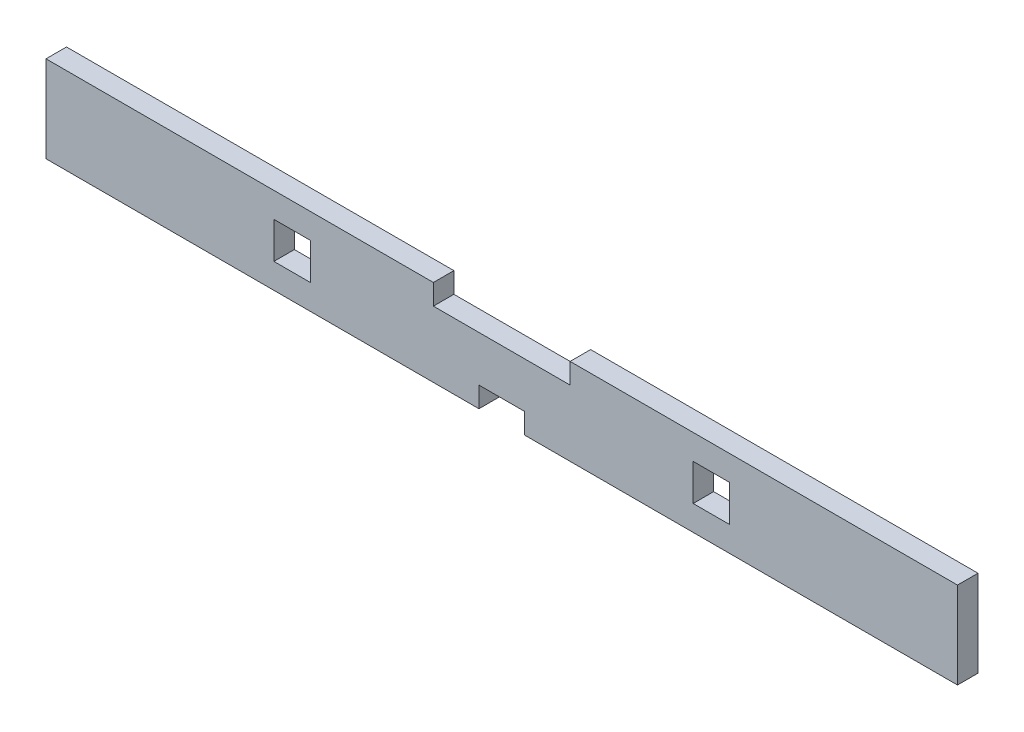
ISO-10303-21;
HEADER;
FILE_DESCRIPTION(('STEP AP214'),'2;1');
FILE_NAME('part.step','',(''),(''),'','','');
FILE_SCHEMA(('AUTOMOTIVE_DESIGN { 1 0 10303 214 1 1 1 1 }'));
ENDSEC;
DATA;
#1=APPLICATION_CONTEXT('core data for automotive mechanical design processes');
#2=APPLICATION_PROTOCOL_DEFINITION('international standard','automotive_design',2000,#1);
#3=PRODUCT_CONTEXT('',#1,'mechanical');
#4=PRODUCT('Part','Part','',(#3));
#5=PRODUCT_RELATED_PRODUCT_CATEGORY('part','',(#4));
#6=PRODUCT_DEFINITION_FORMATION('','',#4);
#7=PRODUCT_DEFINITION_CONTEXT('part definition',#1,'design');
#8=PRODUCT_DEFINITION('design','',#6,#7);
#9=PRODUCT_DEFINITION_SHAPE('','',#8);
#10=(LENGTH_UNIT() NAMED_UNIT(*) SI_UNIT(.MILLI.,.METRE.));
#11=(NAMED_UNIT(*) PLANE_ANGLE_UNIT() SI_UNIT($,.RADIAN.));
#12=(NAMED_UNIT(*) SI_UNIT($,.STERADIAN.) SOLID_ANGLE_UNIT());
#13=UNCERTAINTY_MEASURE_WITH_UNIT(LENGTH_MEASURE(1.E-05),#10,'distance_accuracy_value','');
#14=(GEOMETRIC_REPRESENTATION_CONTEXT(3) GLOBAL_UNCERTAINTY_ASSIGNED_CONTEXT((#13)) GLOBAL_UNIT_ASSIGNED_CONTEXT((#10,
#11,#12)) REPRESENTATION_CONTEXT('',''));
#15=CARTESIAN_POINT('',(0.,0.,0.));
#16=DIRECTION('',(0.,0.,1.));
#17=DIRECTION('',(1.,0.,0.));
#18=AXIS2_PLACEMENT_3D('',#15,#16,#17);
#19=CARTESIAN_POINT('',(127.,-25.4,5.715));
#20=DIRECTION('',(-1.,0.,0.));
#21=DIRECTION('',(0.,0.,1.));
#22=AXIS2_PLACEMENT_3D('',#19,#20,#21);
#23=PLANE('',#22);
#24=DIRECTION('',(0.,1.,0.));
#25=VECTOR('',#24,1.);
#26=CARTESIAN_POINT('',(127.,-25.4,0.));
#27=LINE('',#26,#25);
#28=CARTESIAN_POINT('',(127.,-12.065,0.));
#29=VERTEX_POINT('',#28);
#30=CARTESIAN_POINT('',(127.,12.065,0.));
#31=VERTEX_POINT('',#30);
#32=EDGE_CURVE('E210',#29,#31,#27,.T.);
#33=ORIENTED_EDGE('',*,*,#32,.T.);
#34=DIRECTION('',(0.,0.,1.));
#35=VECTOR('',#34,1.);
#36=CARTESIAN_POINT('',(127.,12.065,0.));
#37=LINE('',#36,#35);
#38=CARTESIAN_POINT('',(127.,12.065,5.715));
#39=VERTEX_POINT('',#38);
#40=EDGE_CURVE('E201',#31,#39,#37,.T.);
#41=ORIENTED_EDGE('',*,*,#40,.T.);
#42=DIRECTION('',(0.,1.,0.));
#43=VECTOR('',#42,1.);
#44=CARTESIAN_POINT('',(127.,-25.4,5.715));
#45=LINE('',#44,#43);
#46=CARTESIAN_POINT('',(127.,-12.065,5.715));
#47=VERTEX_POINT('',#46);
#48=EDGE_CURVE('E52',#47,#39,#45,.T.);
#49=ORIENTED_EDGE('',*,*,#48,.F.);
#50=DIRECTION('',(0.,0.,1.));
#51=VECTOR('',#50,1.);
#52=CARTESIAN_POINT('',(127.,-12.065,0.));
#53=LINE('',#52,#51);
#54=EDGE_CURVE('E378',#29,#47,#53,.T.);
#55=ORIENTED_EDGE('',*,*,#54,.F.);
#56=EDGE_LOOP('',(#33,#41,#49,#55));
#57=FACE_BOUND('',#56,.T.);
#58=ADVANCED_FACE('F43',(#57),#23,.F.);
#59=CARTESIAN_POINT('',(-127.,-25.4,5.715));
#60=DIRECTION('',(1.,0.,0.));
#61=DIRECTION('',(0.,0.,-1.));
#62=AXIS2_PLACEMENT_3D('',#59,#60,#61);
#63=PLANE('',#62);
#64=DIRECTION('',(0.,-1.,0.));
#65=VECTOR('',#64,1.);
#66=CARTESIAN_POINT('',(-127.,-25.4,5.715));
#67=LINE('',#66,#65);
#68=CARTESIAN_POINT('',(-127.,12.065,5.715));
#69=VERTEX_POINT('',#68);
#70=CARTESIAN_POINT('',(-127.,-12.065,5.715));
#71=VERTEX_POINT('',#70);
#72=EDGE_CURVE('E11',#69,#71,#67,.T.);
#73=ORIENTED_EDGE('',*,*,#72,.F.);
#74=DIRECTION('',(0.,0.,1.));
#75=VECTOR('',#74,1.);
#76=CARTESIAN_POINT('',(-127.,12.065,0.));
#77=LINE('',#76,#75);
#78=CARTESIAN_POINT('',(-127.,12.065,0.));
#79=VERTEX_POINT('',#78);
#80=EDGE_CURVE('E184',#79,#69,#77,.T.);
#81=ORIENTED_EDGE('',*,*,#80,.F.);
#82=DIRECTION('',(0.,-1.,0.));
#83=VECTOR('',#82,1.);
#84=CARTESIAN_POINT('',(-127.,-25.4,0.));
#85=LINE('',#84,#83);
#86=CARTESIAN_POINT('',(-127.,-12.065,0.));
#87=VERTEX_POINT('',#86);
#88=EDGE_CURVE('E46',#79,#87,#85,.T.);
#89=ORIENTED_EDGE('',*,*,#88,.T.);
#90=DIRECTION('',(0.,0.,1.));
#91=VECTOR('',#90,1.);
#92=CARTESIAN_POINT('',(-127.,-12.065,0.));
#93=LINE('',#92,#91);
#94=EDGE_CURVE('E375',#87,#71,#93,.T.);
#95=ORIENTED_EDGE('',*,*,#94,.T.);
#96=EDGE_LOOP('',(#73,#81,#89,#95));
#97=FACE_BOUND('',#96,.T.);
#98=ADVANCED_FACE('F198',(#97),#63,.F.);
#99=CARTESIAN_POINT('',(0.,0.,5.715));
#100=DIRECTION('',(0.,0.,-1.));
#101=DIRECTION('',(-1.,0.,0.));
#102=AXIS2_PLACEMENT_3D('',#99,#100,#101);
#103=PLANE('',#102);
#104=ORIENTED_EDGE('',*,*,#48,.T.);
#105=DIRECTION('',(1.,0.,0.));
#106=VECTOR('',#105,1.);
#107=CARTESIAN_POINT('',(0.,12.065,5.715));
#108=LINE('',#107,#106);
#109=CARTESIAN_POINT('',(19.05,12.065,5.715));
#110=VERTEX_POINT('',#109);
#111=EDGE_CURVE('E381',#110,#39,#108,.T.);
#112=ORIENTED_EDGE('',*,*,#111,.F.);
#113=DIRECTION('',(0.,1.,0.));
#114=VECTOR('',#113,1.);
#115=CARTESIAN_POINT('',(19.05,6.35,5.715));
#116=LINE('',#115,#114);
#117=CARTESIAN_POINT('',(19.05,6.35,5.715));
#118=VERTEX_POINT('',#117);
#119=EDGE_CURVE('E238',#118,#110,#116,.T.);
#120=ORIENTED_EDGE('',*,*,#119,.F.);
#121=DIRECTION('',(1.,0.,0.));
#122=VECTOR('',#121,1.);
#123=CARTESIAN_POINT('',(-19.05,6.35,5.715));
#124=LINE('',#123,#122);
#125=CARTESIAN_POINT('',(-19.05,6.35,5.715));
#126=VERTEX_POINT('',#125);
#127=EDGE_CURVE('E229',#126,#118,#124,.T.);
#128=ORIENTED_EDGE('',*,*,#127,.F.);
#129=DIRECTION('',(0.,-1.,0.));
#130=VECTOR('',#129,1.);
#131=CARTESIAN_POINT('',(-19.05,6.35,5.715));
#132=LINE('',#131,#130);
#133=CARTESIAN_POINT('',(-19.05,12.065,5.715));
#134=VERTEX_POINT('',#133);
#135=EDGE_CURVE('E243',#134,#126,#132,.T.);
#136=ORIENTED_EDGE('',*,*,#135,.F.);
#137=EDGE_CURVE('E392',#69,#134,#108,.T.);
#138=ORIENTED_EDGE('',*,*,#137,.F.);
#139=ORIENTED_EDGE('',*,*,#72,.T.);
#140=DIRECTION('',(1.,0.,0.));
#141=VECTOR('',#140,1.);
#142=CARTESIAN_POINT('',(0.,-12.065,5.715));
#143=LINE('',#142,#141);
#144=CARTESIAN_POINT('',(-6.35,-12.065,5.715));
#145=VERTEX_POINT('',#144);
#146=EDGE_CURVE('E382',#71,#145,#143,.T.);
#147=ORIENTED_EDGE('',*,*,#146,.T.);
#148=DIRECTION('',(0.,-1.,0.));
#149=VECTOR('',#148,1.);
#150=CARTESIAN_POINT('',(-6.35,-12.065,5.715));
#151=LINE('',#150,#149);
#152=CARTESIAN_POINT('',(-6.35,-6.35,5.715));
#153=VERTEX_POINT('',#152);
#154=EDGE_CURVE('E264',#153,#145,#151,.T.);
#155=ORIENTED_EDGE('',*,*,#154,.F.);
#156=DIRECTION('',(-1.,0.,0.));
#157=VECTOR('',#156,1.);
#158=CARTESIAN_POINT('',(-6.35,-6.35,5.715));
#159=LINE('',#158,#157);
#160=CARTESIAN_POINT('',(6.35,-6.35,5.715));
#161=VERTEX_POINT('',#160);
#162=EDGE_CURVE('E277',#161,#153,#159,.T.);
#163=ORIENTED_EDGE('',*,*,#162,.F.);
#164=DIRECTION('',(0.,1.,0.));
#165=VECTOR('',#164,1.);
#166=CARTESIAN_POINT('',(6.35,-12.065,5.715));
#167=LINE('',#166,#165);
#168=CARTESIAN_POINT('',(6.35,-12.065,5.715));
#169=VERTEX_POINT('',#168);
#170=EDGE_CURVE('E273',#169,#161,#167,.T.);
#171=ORIENTED_EDGE('',*,*,#170,.F.);
#172=EDGE_CURVE('E387',#169,#47,#143,.T.);
#173=ORIENTED_EDGE('',*,*,#172,.T.);
#174=EDGE_LOOP('',(#104,#112,#120,#128,#136,#138,#139,#147,#155,#163,#171,#173));
#175=FACE_BOUND('',#174,.T.);
#176=DIRECTION('',(-1.,0.,0.));
#177=VECTOR('',#176,1.);
#178=CARTESIAN_POINT('',(53.3400000000001,5.08,5.715));
#179=LINE('',#178,#177);
#180=CARTESIAN_POINT('',(63.5000000000001,5.08,5.715));
#181=VERTEX_POINT('',#180);
#182=CARTESIAN_POINT('',(53.3400000000001,5.08,5.715));
#183=VERTEX_POINT('',#182);
#184=EDGE_CURVE('E316',#181,#183,#179,.T.);
#185=ORIENTED_EDGE('',*,*,#184,.F.);
#186=DIRECTION('',(0.,1.,0.));
#187=VECTOR('',#186,1.);
#188=CARTESIAN_POINT('',(63.5000000000001,-5.08,5.715));
#189=LINE('',#188,#187);
#190=CARTESIAN_POINT('',(63.5000000000001,-5.08,5.715));
#191=VERTEX_POINT('',#190);
#192=EDGE_CURVE('E68',#191,#181,#189,.T.);
#193=ORIENTED_EDGE('',*,*,#192,.F.);
#194=DIRECTION('',(1.,0.,0.));
#195=VECTOR('',#194,1.);
#196=CARTESIAN_POINT('',(53.3400000000001,-5.08,5.715));
#197=LINE('',#196,#195);
#198=CARTESIAN_POINT('',(53.3400000000001,-5.08,5.715));
#199=VERTEX_POINT('',#198);
#200=EDGE_CURVE('E300',#199,#191,#197,.T.);
#201=ORIENTED_EDGE('',*,*,#200,.F.);
#202=DIRECTION('',(0.,-1.,0.));
#203=VECTOR('',#202,1.);
#204=CARTESIAN_POINT('',(53.3400000000001,-5.08,5.715));
#205=LINE('',#204,#203);
#206=EDGE_CURVE('E320',#183,#199,#205,.T.);
#207=ORIENTED_EDGE('',*,*,#206,.F.);
#208=EDGE_LOOP('',(#185,#193,#201,#207));
#209=FACE_BOUND('',#208,.T.);
#210=DIRECTION('',(-1.,0.,0.));
#211=VECTOR('',#210,1.);
#212=CARTESIAN_POINT('',(-63.4999999999999,5.08000000000001,5.715));
#213=LINE('',#212,#211);
#214=CARTESIAN_POINT('',(-53.3399999999999,5.08000000000001,5.715));
#215=VERTEX_POINT('',#214);
#216=CARTESIAN_POINT('',(-63.4999999999999,5.08000000000001,5.715));
#217=VERTEX_POINT('',#216);
#218=EDGE_CURVE('E355',#215,#217,#213,.T.);
#219=ORIENTED_EDGE('',*,*,#218,.F.);
#220=DIRECTION('',(0.,1.,0.));
#221=VECTOR('',#220,1.);
#222=CARTESIAN_POINT('',(-53.3399999999999,-5.07999999999999,5.715));
#223=LINE('',#222,#221);
#224=CARTESIAN_POINT('',(-53.3399999999999,-5.07999999999999,5.715));
#225=VERTEX_POINT('',#224);
#226=EDGE_CURVE('E60',#225,#215,#223,.T.);
#227=ORIENTED_EDGE('',*,*,#226,.F.);
#228=DIRECTION('',(1.,0.,0.));
#229=VECTOR('',#228,1.);
#230=CARTESIAN_POINT('',(-63.4999999999999,-5.07999999999999,5.715));
#231=LINE('',#230,#229);
#232=CARTESIAN_POINT('',(-63.4999999999999,-5.07999999999999,5.715));
#233=VERTEX_POINT('',#232);
#234=EDGE_CURVE('E346',#233,#225,#231,.T.);
#235=ORIENTED_EDGE('',*,*,#234,.F.);
#236=DIRECTION('',(0.,-1.,0.));
#237=VECTOR('',#236,1.);
#238=CARTESIAN_POINT('',(-63.4999999999999,-5.07999999999999,5.715));
#239=LINE('',#238,#237);
#240=EDGE_CURVE('E351',#217,#233,#239,.T.);
#241=ORIENTED_EDGE('',*,*,#240,.F.);
#242=EDGE_LOOP('',(#219,#227,#235,#241));
#243=FACE_BOUND('',#242,.T.);
#244=ADVANCED_FACE('F404',(#175,#209,#243),#103,.F.);
#245=CARTESIAN_POINT('',(0.,0.,0.));
#246=DIRECTION('',(0.,0.,-1.));
#247=DIRECTION('',(-1.,0.,0.));
#248=AXIS2_PLACEMENT_3D('',#245,#246,#247);
#249=PLANE('',#248);
#250=DIRECTION('',(1.,0.,0.));
#251=VECTOR('',#250,1.);
#252=CARTESIAN_POINT('',(0.,12.065,0.));
#253=LINE('',#252,#251);
#254=CARTESIAN_POINT('',(19.05,12.065,0.));
#255=VERTEX_POINT('',#254);
#256=EDGE_CURVE('E193',#255,#31,#253,.T.);
#257=ORIENTED_EDGE('',*,*,#256,.T.);
#258=ORIENTED_EDGE('',*,*,#32,.F.);
#259=DIRECTION('',(1.,0.,0.));
#260=VECTOR('',#259,1.);
#261=CARTESIAN_POINT('',(0.,-12.065,0.));
#262=LINE('',#261,#260);
#263=CARTESIAN_POINT('',(6.35,-12.065,0.));
#264=VERTEX_POINT('',#263);
#265=EDGE_CURVE('E386',#264,#29,#262,.T.);
#266=ORIENTED_EDGE('',*,*,#265,.F.);
#267=DIRECTION('',(0.,1.,0.));
#268=VECTOR('',#267,1.);
#269=CARTESIAN_POINT('',(6.35,-12.065,0.));
#270=LINE('',#269,#268);
#271=CARTESIAN_POINT('',(6.35,-6.35,0.));
#272=VERTEX_POINT('',#271);
#273=EDGE_CURVE('E260',#264,#272,#270,.T.);
#274=ORIENTED_EDGE('',*,*,#273,.T.);
#275=DIRECTION('',(-1.,0.,0.));
#276=VECTOR('',#275,1.);
#277=CARTESIAN_POINT('',(-6.35,-6.35,0.));
#278=LINE('',#277,#276);
#279=CARTESIAN_POINT('',(-6.35,-6.35,0.));
#280=VERTEX_POINT('',#279);
#281=EDGE_CURVE('E265',#272,#280,#278,.T.);
#282=ORIENTED_EDGE('',*,*,#281,.T.);
#283=DIRECTION('',(0.,-1.,0.));
#284=VECTOR('',#283,1.);
#285=CARTESIAN_POINT('',(-6.35,-12.065,0.));
#286=LINE('',#285,#284);
#287=CARTESIAN_POINT('',(-6.35,-12.065,0.));
#288=VERTEX_POINT('',#287);
#289=EDGE_CURVE('E269',#280,#288,#286,.T.);
#290=ORIENTED_EDGE('',*,*,#289,.T.);
#291=EDGE_CURVE('E208',#87,#288,#262,.T.);
#292=ORIENTED_EDGE('',*,*,#291,.F.);
#293=ORIENTED_EDGE('',*,*,#88,.F.);
#294=CARTESIAN_POINT('',(-19.05,12.065,0.));
#295=VERTEX_POINT('',#294);
#296=EDGE_CURVE('E181',#79,#295,#253,.T.);
#297=ORIENTED_EDGE('',*,*,#296,.T.);
#298=DIRECTION('',(0.,-1.,0.));
#299=VECTOR('',#298,1.);
#300=CARTESIAN_POINT('',(-19.05,6.35,0.));
#301=LINE('',#300,#299);
#302=CARTESIAN_POINT('',(-19.05,6.35,0.));
#303=VERTEX_POINT('',#302);
#304=EDGE_CURVE('E230',#295,#303,#301,.T.);
#305=ORIENTED_EDGE('',*,*,#304,.T.);
#306=DIRECTION('',(1.,0.,0.));
#307=VECTOR('',#306,1.);
#308=CARTESIAN_POINT('',(-19.05,6.35,0.));
#309=LINE('',#308,#307);
#310=CARTESIAN_POINT('',(19.05,6.35,0.));
#311=VERTEX_POINT('',#310);
#312=EDGE_CURVE('E233',#303,#311,#309,.T.);
#313=ORIENTED_EDGE('',*,*,#312,.T.);
#314=DIRECTION('',(0.,1.,0.));
#315=VECTOR('',#314,1.);
#316=CARTESIAN_POINT('',(19.05,6.35,0.));
#317=LINE('',#316,#315);
#318=EDGE_CURVE('E225',#311,#255,#317,.T.);
#319=ORIENTED_EDGE('',*,*,#318,.T.);
#320=EDGE_LOOP('',(#257,#258,#266,#274,#282,#290,#292,#293,#297,#305,#313,#319));
#321=FACE_BOUND('',#320,.T.);
#322=DIRECTION('',(0.,1.,0.));
#323=VECTOR('',#322,1.);
#324=CARTESIAN_POINT('',(-53.3399999999999,-5.07999999999999,0.));
#325=LINE('',#324,#323);
#326=CARTESIAN_POINT('',(-53.3399999999999,-5.07999999999999,0.));
#327=VERTEX_POINT('',#326);
#328=CARTESIAN_POINT('',(-53.3399999999999,5.08000000000001,0.));
#329=VERTEX_POINT('',#328);
#330=EDGE_CURVE('E350',#327,#329,#325,.T.);
#331=ORIENTED_EDGE('',*,*,#330,.T.);
#332=DIRECTION('',(-1.,0.,0.));
#333=VECTOR('',#332,1.);
#334=CARTESIAN_POINT('',(-63.4999999999999,5.08000000000001,0.));
#335=LINE('',#334,#333);
#336=CARTESIAN_POINT('',(-63.4999999999999,5.08000000000001,0.));
#337=VERTEX_POINT('',#336);
#338=EDGE_CURVE('E368',#329,#337,#335,.T.);
#339=ORIENTED_EDGE('',*,*,#338,.T.);
#340=DIRECTION('',(0.,-1.,0.));
#341=VECTOR('',#340,1.);
#342=CARTESIAN_POINT('',(-63.4999999999999,-5.07999999999999,0.));
#343=LINE('',#342,#341);
#344=CARTESIAN_POINT('',(-63.4999999999999,-5.07999999999999,0.));
#345=VERTEX_POINT('',#344);
#346=EDGE_CURVE('E364',#337,#345,#343,.T.);
#347=ORIENTED_EDGE('',*,*,#346,.T.);
#348=DIRECTION('',(1.,0.,0.));
#349=VECTOR('',#348,1.);
#350=CARTESIAN_POINT('',(-63.4999999999999,-5.07999999999999,0.));
#351=LINE('',#350,#349);
#352=EDGE_CURVE('E341',#345,#327,#351,.T.);
#353=ORIENTED_EDGE('',*,*,#352,.T.);
#354=EDGE_LOOP('',(#331,#339,#347,#353));
#355=FACE_BOUND('',#354,.T.);
#356=DIRECTION('',(0.,1.,0.));
#357=VECTOR('',#356,1.);
#358=CARTESIAN_POINT('',(63.5000000000001,-5.08,0.));
#359=LINE('',#358,#357);
#360=CARTESIAN_POINT('',(63.5000000000001,-5.08,0.));
#361=VERTEX_POINT('',#360);
#362=CARTESIAN_POINT('',(63.5000000000001,5.08,0.));
#363=VERTEX_POINT('',#362);
#364=EDGE_CURVE('E296',#361,#363,#359,.T.);
#365=ORIENTED_EDGE('',*,*,#364,.T.);
#366=DIRECTION('',(-1.,0.,0.));
#367=VECTOR('',#366,1.);
#368=CARTESIAN_POINT('',(53.3400000000001,5.08,0.));
#369=LINE('',#368,#367);
#370=CARTESIAN_POINT('',(53.3400000000001,5.08,0.));
#371=VERTEX_POINT('',#370);
#372=EDGE_CURVE('E301',#363,#371,#369,.T.);
#373=ORIENTED_EDGE('',*,*,#372,.T.);
#374=DIRECTION('',(0.,-1.,0.));
#375=VECTOR('',#374,1.);
#376=CARTESIAN_POINT('',(53.3400000000001,-5.08,0.));
#377=LINE('',#376,#375);
#378=CARTESIAN_POINT('',(53.3400000000001,-5.08,0.));
#379=VERTEX_POINT('',#378);
#380=EDGE_CURVE('E305',#371,#379,#377,.T.);
#381=ORIENTED_EDGE('',*,*,#380,.T.);
#382=DIRECTION('',(1.,0.,0.));
#383=VECTOR('',#382,1.);
#384=CARTESIAN_POINT('',(53.3400000000001,-5.08,0.));
#385=LINE('',#384,#383);
#386=EDGE_CURVE('E309',#379,#361,#385,.T.);
#387=ORIENTED_EDGE('',*,*,#386,.T.);
#388=EDGE_LOOP('',(#365,#373,#381,#387));
#389=FACE_BOUND('',#388,.T.);
#390=ADVANCED_FACE('F205',(#321,#355,#389),#249,.T.);
#391=CARTESIAN_POINT('',(19.05,6.35,0.));
#392=DIRECTION('',(1.,0.,0.));
#393=DIRECTION('',(0.,0.,-1.));
#394=AXIS2_PLACEMENT_3D('',#391,#392,#393);
#395=PLANE('',#394);
#396=ORIENTED_EDGE('',*,*,#119,.T.);
#397=DIRECTION('',(0.,0.,1.));
#398=VECTOR('',#397,1.);
#399=CARTESIAN_POINT('',(19.05,12.065,0.));
#400=LINE('',#399,#398);
#401=EDGE_CURVE('E237',#255,#110,#400,.T.);
#402=ORIENTED_EDGE('',*,*,#401,.F.);
#403=ORIENTED_EDGE('',*,*,#318,.F.);
#404=DIRECTION('',(0.,0.,1.));
#405=VECTOR('',#404,1.);
#406=CARTESIAN_POINT('',(19.05,6.35,0.));
#407=LINE('',#406,#405);
#408=EDGE_CURVE('E250',#311,#118,#407,.T.);
#409=ORIENTED_EDGE('',*,*,#408,.T.);
#410=EDGE_LOOP('',(#396,#402,#403,#409));
#411=FACE_BOUND('',#410,.T.);
#412=ADVANCED_FACE('F416',(#411),#395,.F.);
#413=CARTESIAN_POINT('',(-19.05,6.35,0.));
#414=DIRECTION('',(0.,-1.,0.));
#415=DIRECTION('',(0.,0.,-1.));
#416=AXIS2_PLACEMENT_3D('',#413,#414,#415);
#417=PLANE('',#416);
#418=ORIENTED_EDGE('',*,*,#127,.T.);
#419=ORIENTED_EDGE('',*,*,#408,.F.);
#420=ORIENTED_EDGE('',*,*,#312,.F.);
#421=DIRECTION('',(0.,0.,1.));
#422=VECTOR('',#421,1.);
#423=CARTESIAN_POINT('',(-19.05,6.35,0.));
#424=LINE('',#423,#422);
#425=EDGE_CURVE('E253',#303,#126,#424,.T.);
#426=ORIENTED_EDGE('',*,*,#425,.T.);
#427=EDGE_LOOP('',(#418,#419,#420,#426));
#428=FACE_BOUND('',#427,.T.);
#429=ADVANCED_FACE('F420',(#428),#417,.F.);
#430=CARTESIAN_POINT('',(-19.05,6.35,0.));
#431=DIRECTION('',(-1.,0.,0.));
#432=DIRECTION('',(0.,0.,1.));
#433=AXIS2_PLACEMENT_3D('',#430,#431,#432);
#434=PLANE('',#433);
#435=ORIENTED_EDGE('',*,*,#135,.T.);
#436=ORIENTED_EDGE('',*,*,#425,.F.);
#437=ORIENTED_EDGE('',*,*,#304,.F.);
#438=DIRECTION('',(0.,0.,1.));
#439=VECTOR('',#438,1.);
#440=CARTESIAN_POINT('',(-19.05,12.065,0.));
#441=LINE('',#440,#439);
#442=EDGE_CURVE('E187',#295,#134,#441,.T.);
#443=ORIENTED_EDGE('',*,*,#442,.T.);
#444=EDGE_LOOP('',(#435,#436,#437,#443));
#445=FACE_BOUND('',#444,.T.);
#446=ADVANCED_FACE('F423',(#445),#434,.F.);
#447=CARTESIAN_POINT('',(6.35,-12.065,0.));
#448=DIRECTION('',(1.,0.,0.));
#449=DIRECTION('',(0.,0.,-1.));
#450=AXIS2_PLACEMENT_3D('',#447,#448,#449);
#451=PLANE('',#450);
#452=ORIENTED_EDGE('',*,*,#170,.T.);
#453=DIRECTION('',(0.,0.,1.));
#454=VECTOR('',#453,1.);
#455=CARTESIAN_POINT('',(6.35,-6.35,0.));
#456=LINE('',#455,#454);
#457=EDGE_CURVE('E272',#272,#161,#456,.T.);
#458=ORIENTED_EDGE('',*,*,#457,.F.);
#459=ORIENTED_EDGE('',*,*,#273,.F.);
#460=DIRECTION('',(0.,0.,1.));
#461=VECTOR('',#460,1.);
#462=CARTESIAN_POINT('',(6.35,-12.065,0.));
#463=LINE('',#462,#461);
#464=EDGE_CURVE('E242',#264,#169,#463,.T.);
#465=ORIENTED_EDGE('',*,*,#464,.T.);
#466=EDGE_LOOP('',(#452,#458,#459,#465));
#467=FACE_BOUND('',#466,.T.);
#468=ADVANCED_FACE('F425',(#467),#451,.F.);
#469=CARTESIAN_POINT('',(-6.35,-12.065,0.));
#470=DIRECTION('',(-1.,0.,0.));
#471=DIRECTION('',(0.,0.,1.));
#472=AXIS2_PLACEMENT_3D('',#469,#470,#471);
#473=PLANE('',#472);
#474=ORIENTED_EDGE('',*,*,#154,.T.);
#475=DIRECTION('',(0.,0.,1.));
#476=VECTOR('',#475,1.);
#477=CARTESIAN_POINT('',(-6.35,-12.065,0.));
#478=LINE('',#477,#476);
#479=EDGE_CURVE('E287',#288,#145,#478,.T.);
#480=ORIENTED_EDGE('',*,*,#479,.F.);
#481=ORIENTED_EDGE('',*,*,#289,.F.);
#482=DIRECTION('',(0.,0.,1.));
#483=VECTOR('',#482,1.);
#484=CARTESIAN_POINT('',(-6.35,-6.35,0.));
#485=LINE('',#484,#483);
#486=EDGE_CURVE('E290',#280,#153,#485,.T.);
#487=ORIENTED_EDGE('',*,*,#486,.T.);
#488=EDGE_LOOP('',(#474,#480,#481,#487));
#489=FACE_BOUND('',#488,.T.);
#490=ADVANCED_FACE('F431',(#489),#473,.F.);
#491=CARTESIAN_POINT('',(-6.35,-6.35,0.));
#492=DIRECTION('',(0.,1.,0.));
#493=DIRECTION('',(0.,0.,1.));
#494=AXIS2_PLACEMENT_3D('',#491,#492,#493);
#495=PLANE('',#494);
#496=ORIENTED_EDGE('',*,*,#162,.T.);
#497=ORIENTED_EDGE('',*,*,#486,.F.);
#498=ORIENTED_EDGE('',*,*,#281,.F.);
#499=ORIENTED_EDGE('',*,*,#457,.T.);
#500=EDGE_LOOP('',(#496,#497,#498,#499));
#501=FACE_BOUND('',#500,.T.);
#502=ADVANCED_FACE('F454',(#501),#495,.F.);
#503=CARTESIAN_POINT('',(63.5000000000001,-5.08,0.));
#504=DIRECTION('',(1.,0.,0.));
#505=DIRECTION('',(0.,0.,-1.));
#506=AXIS2_PLACEMENT_3D('',#503,#504,#505);
#507=PLANE('',#506);
#508=ORIENTED_EDGE('',*,*,#192,.T.);
#509=DIRECTION('',(0.,0.,1.));
#510=VECTOR('',#509,1.);
#511=CARTESIAN_POINT('',(63.5000000000001,5.08,0.));
#512=LINE('',#511,#510);
#513=EDGE_CURVE('E313',#363,#181,#512,.T.);
#514=ORIENTED_EDGE('',*,*,#513,.F.);
#515=ORIENTED_EDGE('',*,*,#364,.F.);
#516=DIRECTION('',(0.,0.,1.));
#517=VECTOR('',#516,1.);
#518=CARTESIAN_POINT('',(63.5000000000001,-5.08,0.));
#519=LINE('',#518,#517);
#520=EDGE_CURVE('E276',#361,#191,#519,.T.);
#521=ORIENTED_EDGE('',*,*,#520,.T.);
#522=EDGE_LOOP('',(#508,#514,#515,#521));
#523=FACE_BOUND('',#522,.T.);
#524=ADVANCED_FACE('F457',(#523),#507,.F.);
#525=CARTESIAN_POINT('',(53.3400000000001,-5.08,0.));
#526=DIRECTION('',(0.,-1.,0.));
#527=DIRECTION('',(0.,0.,-1.));
#528=AXIS2_PLACEMENT_3D('',#525,#526,#527);
#529=PLANE('',#528);
#530=ORIENTED_EDGE('',*,*,#200,.T.);
#531=ORIENTED_EDGE('',*,*,#520,.F.);
#532=ORIENTED_EDGE('',*,*,#386,.F.);
#533=DIRECTION('',(0.,0.,1.));
#534=VECTOR('',#533,1.);
#535=CARTESIAN_POINT('',(53.3400000000001,-5.08,0.));
#536=LINE('',#535,#534);
#537=EDGE_CURVE('E329',#379,#199,#536,.T.);
#538=ORIENTED_EDGE('',*,*,#537,.T.);
#539=EDGE_LOOP('',(#530,#531,#532,#538));
#540=FACE_BOUND('',#539,.T.);
#541=ADVANCED_FACE('F460',(#540),#529,.F.);
#542=CARTESIAN_POINT('',(53.3400000000001,-5.08,0.));
#543=DIRECTION('',(-1.,0.,0.));
#544=DIRECTION('',(0.,0.,1.));
#545=AXIS2_PLACEMENT_3D('',#542,#543,#544);
#546=PLANE('',#545);
#547=ORIENTED_EDGE('',*,*,#206,.T.);
#548=ORIENTED_EDGE('',*,*,#537,.F.);
#549=ORIENTED_EDGE('',*,*,#380,.F.);
#550=DIRECTION('',(0.,0.,1.));
#551=VECTOR('',#550,1.);
#552=CARTESIAN_POINT('',(53.3400000000001,5.08,0.));
#553=LINE('',#552,#551);
#554=EDGE_CURVE('E332',#371,#183,#553,.T.);
#555=ORIENTED_EDGE('',*,*,#554,.T.);
#556=EDGE_LOOP('',(#547,#548,#549,#555));
#557=FACE_BOUND('',#556,.T.);
#558=ADVANCED_FACE('F463',(#557),#546,.F.);
#559=CARTESIAN_POINT('',(53.3400000000001,5.08,0.));
#560=DIRECTION('',(0.,1.,0.));
#561=DIRECTION('',(0.,0.,1.));
#562=AXIS2_PLACEMENT_3D('',#559,#560,#561);
#563=PLANE('',#562);
#564=ORIENTED_EDGE('',*,*,#184,.T.);
#565=ORIENTED_EDGE('',*,*,#554,.F.);
#566=ORIENTED_EDGE('',*,*,#372,.F.);
#567=ORIENTED_EDGE('',*,*,#513,.T.);
#568=EDGE_LOOP('',(#564,#565,#566,#567));
#569=FACE_BOUND('',#568,.T.);
#570=ADVANCED_FACE('F467',(#569),#563,.F.);
#571=CARTESIAN_POINT('',(-53.3399999999999,-5.07999999999999,0.));
#572=DIRECTION('',(1.,0.,0.));
#573=DIRECTION('',(0.,0.,-1.));
#574=AXIS2_PLACEMENT_3D('',#571,#572,#573);
#575=PLANE('',#574);
#576=ORIENTED_EDGE('',*,*,#226,.T.);
#577=DIRECTION('',(0.,0.,1.));
#578=VECTOR('',#577,1.);
#579=CARTESIAN_POINT('',(-53.3399999999999,5.08000000000001,0.));
#580=LINE('',#579,#578);
#581=EDGE_CURVE('E337',#329,#215,#580,.T.);
#582=ORIENTED_EDGE('',*,*,#581,.F.);
#583=ORIENTED_EDGE('',*,*,#330,.F.);
#584=DIRECTION('',(0.,0.,1.));
#585=VECTOR('',#584,1.);
#586=CARTESIAN_POINT('',(-53.3399999999999,-5.07999999999999,0.));
#587=LINE('',#586,#585);
#588=EDGE_CURVE('E216',#327,#225,#587,.T.);
#589=ORIENTED_EDGE('',*,*,#588,.T.);
#590=EDGE_LOOP('',(#576,#582,#583,#589));
#591=FACE_BOUND('',#590,.T.);
#592=ADVANCED_FACE('F471',(#591),#575,.F.);
#593=CARTESIAN_POINT('',(-63.4999999999999,-5.07999999999999,0.));
#594=DIRECTION('',(0.,-1.,0.));
#595=DIRECTION('',(0.,0.,-1.));
#596=AXIS2_PLACEMENT_3D('',#593,#594,#595);
#597=PLANE('',#596);
#598=ORIENTED_EDGE('',*,*,#234,.T.);
#599=ORIENTED_EDGE('',*,*,#588,.F.);
#600=ORIENTED_EDGE('',*,*,#352,.F.);
#601=DIRECTION('',(0.,0.,1.));
#602=VECTOR('',#601,1.);
#603=CARTESIAN_POINT('',(-63.4999999999999,-5.07999999999999,0.));
#604=LINE('',#603,#602);
#605=EDGE_CURVE('E222',#345,#233,#604,.T.);
#606=ORIENTED_EDGE('',*,*,#605,.T.);
#607=EDGE_LOOP('',(#598,#599,#600,#606));
#608=FACE_BOUND('',#607,.T.);
#609=ADVANCED_FACE('F477',(#608),#597,.F.);
#610=CARTESIAN_POINT('',(-63.4999999999999,-5.07999999999999,0.));
#611=DIRECTION('',(-1.,0.,0.));
#612=DIRECTION('',(0.,0.,1.));
#613=AXIS2_PLACEMENT_3D('',#610,#611,#612);
#614=PLANE('',#613);
#615=ORIENTED_EDGE('',*,*,#240,.T.);
#616=ORIENTED_EDGE('',*,*,#605,.F.);
#617=ORIENTED_EDGE('',*,*,#346,.F.);
#618=DIRECTION('',(0.,0.,1.));
#619=VECTOR('',#618,1.);
#620=CARTESIAN_POINT('',(-63.4999999999999,5.08000000000001,0.));
#621=LINE('',#620,#619);
#622=EDGE_CURVE('E340',#337,#217,#621,.T.);
#623=ORIENTED_EDGE('',*,*,#622,.T.);
#624=EDGE_LOOP('',(#615,#616,#617,#623));
#625=FACE_BOUND('',#624,.T.);
#626=ADVANCED_FACE('F482',(#625),#614,.F.);
#627=CARTESIAN_POINT('',(-63.4999999999999,5.08000000000001,0.));
#628=DIRECTION('',(0.,1.,0.));
#629=DIRECTION('',(0.,0.,1.));
#630=AXIS2_PLACEMENT_3D('',#627,#628,#629);
#631=PLANE('',#630);
#632=ORIENTED_EDGE('',*,*,#218,.T.);
#633=ORIENTED_EDGE('',*,*,#622,.F.);
#634=ORIENTED_EDGE('',*,*,#338,.F.);
#635=ORIENTED_EDGE('',*,*,#581,.T.);
#636=EDGE_LOOP('',(#632,#633,#634,#635));
#637=FACE_BOUND('',#636,.T.);
#638=ADVANCED_FACE('F478',(#637),#631,.F.);
#639=CARTESIAN_POINT('',(0.,-12.065,0.));
#640=DIRECTION('',(0.,-1.,0.));
#641=DIRECTION('',(1.,0.,0.));
#642=AXIS2_PLACEMENT_3D('',#639,#640,#641);
#643=PLANE('',#642);
#644=ORIENTED_EDGE('',*,*,#479,.T.);
#645=ORIENTED_EDGE('',*,*,#146,.F.);
#646=ORIENTED_EDGE('',*,*,#94,.F.);
#647=ORIENTED_EDGE('',*,*,#291,.T.);
#648=EDGE_LOOP('',(#644,#645,#646,#647));
#649=FACE_BOUND('',#648,.T.);
#650=ADVANCED_FACE('F481',(#649),#643,.T.);
#651=ORIENTED_EDGE('',*,*,#464,.F.);
#652=ORIENTED_EDGE('',*,*,#265,.T.);
#653=ORIENTED_EDGE('',*,*,#54,.T.);
#654=ORIENTED_EDGE('',*,*,#172,.F.);
#655=EDGE_LOOP('',(#651,#652,#653,#654));
#656=FACE_BOUND('',#655,.T.);
#657=ADVANCED_FACE('F412',(#656),#643,.T.);
#658=CARTESIAN_POINT('',(0.,12.065,0.));
#659=DIRECTION('',(0.,-1.,0.));
#660=DIRECTION('',(1.,0.,0.));
#661=AXIS2_PLACEMENT_3D('',#658,#659,#660);
#662=PLANE('',#661);
#663=ORIENTED_EDGE('',*,*,#296,.F.);
#664=ORIENTED_EDGE('',*,*,#80,.T.);
#665=ORIENTED_EDGE('',*,*,#137,.T.);
#666=ORIENTED_EDGE('',*,*,#442,.F.);
#667=EDGE_LOOP('',(#663,#664,#665,#666));
#668=FACE_BOUND('',#667,.T.);
#669=ADVANCED_FACE('F183',(#668),#662,.F.);
#670=ORIENTED_EDGE('',*,*,#111,.T.);
#671=ORIENTED_EDGE('',*,*,#40,.F.);
#672=ORIENTED_EDGE('',*,*,#256,.F.);
#673=ORIENTED_EDGE('',*,*,#401,.T.);
#674=EDGE_LOOP('',(#670,#671,#672,#673));
#675=FACE_BOUND('',#674,.T.);
#676=ADVANCED_FACE('F398',(#675),#662,.F.);
#677=CLOSED_SHELL('',(#58,#98,#244,#390,#412,#429,#446,#468,#490,#502,#524,#541,#558,#570,#592,
#609,#626,#638,#650,#657,#669,#676));
#678=MANIFOLD_SOLID_BREP('B2',#677);
#679=ADVANCED_BREP_SHAPE_REPRESENTATION('',(#18,#678),#14);
#680=SHAPE_DEFINITION_REPRESENTATION(#9,#679);
ENDSEC;
END-ISO-10303-21;
